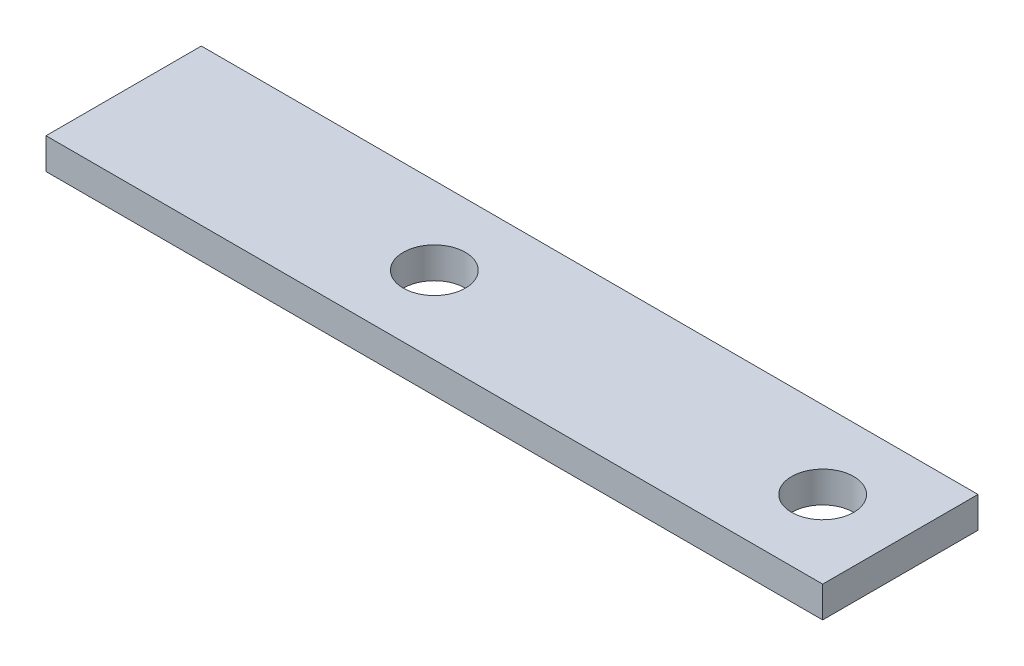
ISO-10303-21;
HEADER;
FILE_DESCRIPTION(('STEP AP214'),'2;1');
FILE_NAME('part.step','',(''),(''),'','','');
FILE_SCHEMA(('AUTOMOTIVE_DESIGN { 1 0 10303 214 1 1 1 1 }'));
ENDSEC;
DATA;
#1=APPLICATION_CONTEXT('core data for automotive mechanical design processes');
#2=APPLICATION_PROTOCOL_DEFINITION('international standard','automotive_design',2000,#1);
#3=PRODUCT_CONTEXT('',#1,'mechanical');
#4=PRODUCT('Part','Part','',(#3));
#5=PRODUCT_RELATED_PRODUCT_CATEGORY('part','',(#4));
#6=PRODUCT_DEFINITION_FORMATION('','',#4);
#7=PRODUCT_DEFINITION_CONTEXT('part definition',#1,'design');
#8=PRODUCT_DEFINITION('design','',#6,#7);
#9=PRODUCT_DEFINITION_SHAPE('','',#8);
#10=(LENGTH_UNIT() NAMED_UNIT(*) SI_UNIT(.MILLI.,.METRE.));
#11=(NAMED_UNIT(*) PLANE_ANGLE_UNIT() SI_UNIT($,.RADIAN.));
#12=(NAMED_UNIT(*) SI_UNIT($,.STERADIAN.) SOLID_ANGLE_UNIT());
#13=UNCERTAINTY_MEASURE_WITH_UNIT(LENGTH_MEASURE(1.E-05),#10,'distance_accuracy_value','');
#14=(GEOMETRIC_REPRESENTATION_CONTEXT(3) GLOBAL_UNCERTAINTY_ASSIGNED_CONTEXT((#13)) GLOBAL_UNIT_ASSIGNED_CONTEXT((#10,
#11,#12)) REPRESENTATION_CONTEXT('',''));
#15=CARTESIAN_POINT('',(0.,0.,0.));
#16=DIRECTION('',(0.,0.,1.));
#17=DIRECTION('',(1.,0.,0.));
#18=AXIS2_PLACEMENT_3D('',#15,#16,#17);
#19=CARTESIAN_POINT('',(100.,-4.,0.));
#20=DIRECTION('',(0.,1.,0.));
#21=DIRECTION('',(0.,0.,1.));
#22=AXIS2_PLACEMENT_3D('',#19,#20,#21);
#23=PLANE('',#22);
#24=CARTESIAN_POINT('',(40.,-4.,-9.99999999999965));
#25=DIRECTION('',(0.,1.,0.));
#26=DIRECTION('',(0.,0.,1.));
#27=AXIS2_PLACEMENT_3D('',#24,#25,#26);
#28=CIRCLE('',#27,4.00000000000001);
#29=CARTESIAN_POINT('',(40.,-4.,-5.99999999999965));
#30=VERTEX_POINT('',#29);
#31=EDGE_CURVE('E112',#30,#30,#28,.T.);
#32=ORIENTED_EDGE('',*,*,#31,.T.);
#33=EDGE_LOOP('',(#32));
#34=FACE_BOUND('',#33,.T.);
#35=CARTESIAN_POINT('',(90.,-4.,-10.));
#36=DIRECTION('',(0.,1.,0.));
#37=DIRECTION('',(0.,0.,1.));
#38=AXIS2_PLACEMENT_3D('',#35,#36,#37);
#39=CIRCLE('',#38,4.00000000000001);
#40=CARTESIAN_POINT('',(90.,-4.,-5.99999999999999));
#41=VERTEX_POINT('',#40);
#42=EDGE_CURVE('E99',#41,#41,#39,.T.);
#43=ORIENTED_EDGE('',*,*,#42,.T.);
#44=EDGE_LOOP('',(#43));
#45=FACE_BOUND('',#44,.T.);
#46=DIRECTION('',(0.,0.,-1.));
#47=VECTOR('',#46,1.);
#48=CARTESIAN_POINT('',(0.,-4.,0.));
#49=LINE('',#48,#47);
#50=CARTESIAN_POINT('',(0.,-4.,0.));
#51=VERTEX_POINT('',#50);
#52=CARTESIAN_POINT('',(0.,-4.,-20.));
#53=VERTEX_POINT('',#52);
#54=EDGE_CURVE('E97',#51,#53,#49,.T.);
#55=ORIENTED_EDGE('',*,*,#54,.T.);
#56=DIRECTION('',(-1.,0.,0.));
#57=VECTOR('',#56,1.);
#58=CARTESIAN_POINT('',(100.,-4.,-20.));
#59=LINE('',#58,#57);
#60=CARTESIAN_POINT('',(100.,-4.,-20.));
#61=VERTEX_POINT('',#60);
#62=EDGE_CURVE('E11',#61,#53,#59,.T.);
#63=ORIENTED_EDGE('',*,*,#62,.F.);
#64=DIRECTION('',(0.,0.,-1.));
#65=VECTOR('',#64,1.);
#66=CARTESIAN_POINT('',(100.,-4.,0.));
#67=LINE('',#66,#65);
#68=CARTESIAN_POINT('',(100.,-4.,0.));
#69=VERTEX_POINT('',#68);
#70=EDGE_CURVE('E74',#69,#61,#67,.T.);
#71=ORIENTED_EDGE('',*,*,#70,.F.);
#72=DIRECTION('',(-1.,0.,0.));
#73=VECTOR('',#72,1.);
#74=CARTESIAN_POINT('',(100.,-4.,0.));
#75=LINE('',#74,#73);
#76=EDGE_CURVE('E50',#69,#51,#75,.T.);
#77=ORIENTED_EDGE('',*,*,#76,.T.);
#78=EDGE_LOOP('',(#55,#63,#71,#77));
#79=FACE_BOUND('',#78,.T.);
#80=ADVANCED_FACE('F34',(#34,#45,#79),#23,.F.);
#81=CARTESIAN_POINT('',(100.,0.,-20.));
#82=DIRECTION('',(0.,0.,-1.));
#83=DIRECTION('',(-1.,0.,0.));
#84=AXIS2_PLACEMENT_3D('',#81,#82,#83);
#85=PLANE('',#84);
#86=DIRECTION('',(0.,-1.,0.));
#87=VECTOR('',#86,1.);
#88=CARTESIAN_POINT('',(0.,0.,-20.));
#89=LINE('',#88,#87);
#90=CARTESIAN_POINT('',(0.,0.,-20.));
#91=VERTEX_POINT('',#90);
#92=EDGE_CURVE('E83',#91,#53,#89,.T.);
#93=ORIENTED_EDGE('',*,*,#92,.F.);
#94=DIRECTION('',(-1.,0.,0.));
#95=VECTOR('',#94,1.);
#96=CARTESIAN_POINT('',(100.,0.,-20.));
#97=LINE('',#96,#95);
#98=CARTESIAN_POINT('',(100.,0.,-20.));
#99=VERTEX_POINT('',#98);
#100=EDGE_CURVE('E42',#99,#91,#97,.T.);
#101=ORIENTED_EDGE('',*,*,#100,.F.);
#102=DIRECTION('',(0.,-1.,0.));
#103=VECTOR('',#102,1.);
#104=CARTESIAN_POINT('',(100.,0.,-20.));
#105=LINE('',#104,#103);
#106=EDGE_CURVE('E81',#99,#61,#105,.T.);
#107=ORIENTED_EDGE('',*,*,#106,.T.);
#108=ORIENTED_EDGE('',*,*,#62,.T.);
#109=EDGE_LOOP('',(#93,#101,#107,#108));
#110=FACE_BOUND('',#109,.T.);
#111=ADVANCED_FACE('F80',(#110),#85,.T.);
#112=CARTESIAN_POINT('',(100.,0.,0.));
#113=DIRECTION('',(0.,1.,0.));
#114=DIRECTION('',(0.,0.,1.));
#115=AXIS2_PLACEMENT_3D('',#112,#113,#114);
#116=PLANE('',#115);
#117=CARTESIAN_POINT('',(40.,0.,-9.99999999999965));
#118=DIRECTION('',(0.,1.,0.));
#119=DIRECTION('',(0.,0.,1.));
#120=AXIS2_PLACEMENT_3D('',#117,#118,#119);
#121=CIRCLE('',#120,4.00000000000001);
#122=CARTESIAN_POINT('',(40.,0.,-5.99999999999965));
#123=VERTEX_POINT('',#122);
#124=EDGE_CURVE('E115',#123,#123,#121,.T.);
#125=ORIENTED_EDGE('',*,*,#124,.F.);
#126=EDGE_LOOP('',(#125));
#127=FACE_BOUND('',#126,.T.);
#128=CARTESIAN_POINT('',(90.,0.,-10.));
#129=DIRECTION('',(0.,1.,0.));
#130=DIRECTION('',(0.,0.,1.));
#131=AXIS2_PLACEMENT_3D('',#128,#129,#130);
#132=CIRCLE('',#131,4.00000000000001);
#133=CARTESIAN_POINT('',(90.,0.,-5.99999999999999));
#134=VERTEX_POINT('',#133);
#135=EDGE_CURVE('E109',#134,#134,#132,.T.);
#136=ORIENTED_EDGE('',*,*,#135,.F.);
#137=EDGE_LOOP('',(#136));
#138=FACE_BOUND('',#137,.T.);
#139=DIRECTION('',(0.,0.,-1.));
#140=VECTOR('',#139,1.);
#141=CARTESIAN_POINT('',(0.,0.,0.));
#142=LINE('',#141,#140);
#143=CARTESIAN_POINT('',(0.,0.,0.));
#144=VERTEX_POINT('',#143);
#145=EDGE_CURVE('E101',#144,#91,#142,.T.);
#146=ORIENTED_EDGE('',*,*,#145,.F.);
#147=DIRECTION('',(-1.,0.,0.));
#148=VECTOR('',#147,1.);
#149=CARTESIAN_POINT('',(100.,0.,0.));
#150=LINE('',#149,#148);
#151=CARTESIAN_POINT('',(100.,0.,0.));
#152=VERTEX_POINT('',#151);
#153=EDGE_CURVE('E63',#152,#144,#150,.T.);
#154=ORIENTED_EDGE('',*,*,#153,.F.);
#155=DIRECTION('',(0.,0.,-1.));
#156=VECTOR('',#155,1.);
#157=CARTESIAN_POINT('',(100.,0.,0.));
#158=LINE('',#157,#156);
#159=EDGE_CURVE('E89',#152,#99,#158,.T.);
#160=ORIENTED_EDGE('',*,*,#159,.T.);
#161=ORIENTED_EDGE('',*,*,#100,.T.);
#162=EDGE_LOOP('',(#146,#154,#160,#161));
#163=FACE_BOUND('',#162,.T.);
#164=ADVANCED_FACE('F91',(#127,#138,#163),#116,.T.);
#165=CARTESIAN_POINT('',(100.,-4.,0.));
#166=DIRECTION('',(0.,0.,1.));
#167=DIRECTION('',(1.,0.,0.));
#168=AXIS2_PLACEMENT_3D('',#165,#166,#167);
#169=PLANE('',#168);
#170=DIRECTION('',(0.,1.,0.));
#171=VECTOR('',#170,1.);
#172=CARTESIAN_POINT('',(0.,-4.,0.));
#173=LINE('',#172,#171);
#174=EDGE_CURVE('E103',#51,#144,#173,.T.);
#175=ORIENTED_EDGE('',*,*,#174,.F.);
#176=ORIENTED_EDGE('',*,*,#76,.F.);
#177=DIRECTION('',(0.,1.,0.));
#178=VECTOR('',#177,1.);
#179=CARTESIAN_POINT('',(100.,-4.,0.));
#180=LINE('',#179,#178);
#181=EDGE_CURVE('E92',#69,#152,#180,.T.);
#182=ORIENTED_EDGE('',*,*,#181,.T.);
#183=ORIENTED_EDGE('',*,*,#153,.T.);
#184=EDGE_LOOP('',(#175,#176,#182,#183));
#185=FACE_BOUND('',#184,.T.);
#186=ADVANCED_FACE('F132',(#185),#169,.T.);
#187=CARTESIAN_POINT('',(100.,0.,0.));
#188=DIRECTION('',(-1.,0.,0.));
#189=DIRECTION('',(0.,0.,1.));
#190=AXIS2_PLACEMENT_3D('',#187,#188,#189);
#191=PLANE('',#190);
#192=ORIENTED_EDGE('',*,*,#70,.T.);
#193=ORIENTED_EDGE('',*,*,#106,.F.);
#194=ORIENTED_EDGE('',*,*,#159,.F.);
#195=ORIENTED_EDGE('',*,*,#181,.F.);
#196=EDGE_LOOP('',(#192,#193,#194,#195));
#197=FACE_BOUND('',#196,.T.);
#198=ADVANCED_FACE('F88',(#197),#191,.F.);
#199=CARTESIAN_POINT('',(0.,0.,0.));
#200=DIRECTION('',(-1.,0.,0.));
#201=DIRECTION('',(0.,0.,1.));
#202=AXIS2_PLACEMENT_3D('',#199,#200,#201);
#203=PLANE('',#202);
#204=ORIENTED_EDGE('',*,*,#54,.F.);
#205=ORIENTED_EDGE('',*,*,#174,.T.);
#206=ORIENTED_EDGE('',*,*,#145,.T.);
#207=ORIENTED_EDGE('',*,*,#92,.T.);
#208=EDGE_LOOP('',(#204,#205,#206,#207));
#209=FACE_BOUND('',#208,.T.);
#210=ADVANCED_FACE('F137',(#209),#203,.T.);
#211=CARTESIAN_POINT('',(90.,-4.,-10.));
#212=DIRECTION('',(0.,1.,0.));
#213=DIRECTION('',(0.,0.,1.));
#214=AXIS2_PLACEMENT_3D('',#211,#212,#213);
#215=CYLINDRICAL_SURFACE('',#214,4.00000000000001);
#216=ORIENTED_EDGE('',*,*,#42,.F.);
#217=EDGE_LOOP('',(#216));
#218=FACE_BOUND('',#217,.T.);
#219=ORIENTED_EDGE('',*,*,#135,.T.);
#220=EDGE_LOOP('',(#219));
#221=FACE_BOUND('',#220,.T.);
#222=ADVANCED_FACE('F126',(#218,#221),#215,.F.);
#223=CARTESIAN_POINT('',(40.,-4.,-9.99999999999965));
#224=DIRECTION('',(0.,1.,0.));
#225=DIRECTION('',(0.,0.,1.));
#226=AXIS2_PLACEMENT_3D('',#223,#224,#225);
#227=CYLINDRICAL_SURFACE('',#226,4.00000000000001);
#228=ORIENTED_EDGE('',*,*,#31,.F.);
#229=EDGE_LOOP('',(#228));
#230=FACE_BOUND('',#229,.T.);
#231=ORIENTED_EDGE('',*,*,#124,.T.);
#232=EDGE_LOOP('',(#231));
#233=FACE_BOUND('',#232,.T.);
#234=ADVANCED_FACE('F123',(#230,#233),#227,.F.);
#235=CLOSED_SHELL('',(#80,#111,#164,#186,#198,#210,#222,#234));
#236=MANIFOLD_SOLID_BREP('B2',#235);
#237=ADVANCED_BREP_SHAPE_REPRESENTATION('',(#18,#236),#14);
#238=SHAPE_DEFINITION_REPRESENTATION(#9,#237);
ENDSEC;
END-ISO-10303-21;
